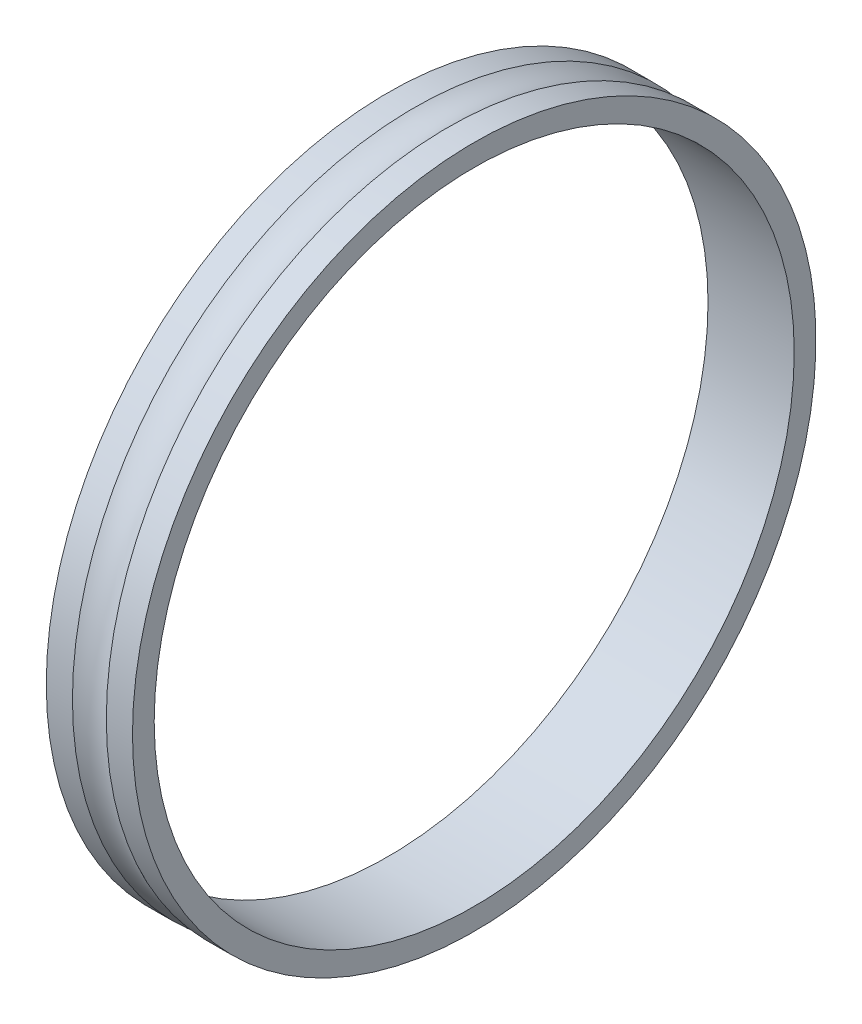
ISO-10303-21;
HEADER;
FILE_DESCRIPTION(('STEP AP214'),'2;1');
FILE_NAME('part.step','',(''),(''),'','','');
FILE_SCHEMA(('AUTOMOTIVE_DESIGN { 1 0 10303 214 1 1 1 1 }'));
ENDSEC;
DATA;
#1=APPLICATION_CONTEXT('core data for automotive mechanical design processes');
#2=APPLICATION_PROTOCOL_DEFINITION('international standard','automotive_design',2000,#1);
#3=PRODUCT_CONTEXT('',#1,'mechanical');
#4=PRODUCT('Part','Part','',(#3));
#5=PRODUCT_RELATED_PRODUCT_CATEGORY('part','',(#4));
#6=PRODUCT_DEFINITION_FORMATION('','',#4);
#7=PRODUCT_DEFINITION_CONTEXT('part definition',#1,'design');
#8=PRODUCT_DEFINITION('design','',#6,#7);
#9=PRODUCT_DEFINITION_SHAPE('','',#8);
#10=(LENGTH_UNIT() NAMED_UNIT(*) SI_UNIT(.MILLI.,.METRE.));
#11=(NAMED_UNIT(*) PLANE_ANGLE_UNIT() SI_UNIT($,.RADIAN.));
#12=(NAMED_UNIT(*) SI_UNIT($,.STERADIAN.) SOLID_ANGLE_UNIT());
#13=UNCERTAINTY_MEASURE_WITH_UNIT(LENGTH_MEASURE(1.E-05),#10,'distance_accuracy_value','');
#14=(GEOMETRIC_REPRESENTATION_CONTEXT(3) GLOBAL_UNCERTAINTY_ASSIGNED_CONTEXT((#13)) GLOBAL_UNIT_ASSIGNED_CONTEXT((#10,
#11,#12)) REPRESENTATION_CONTEXT('',''));
#15=CARTESIAN_POINT('',(0.,0.,0.));
#16=DIRECTION('',(0.,0.,1.));
#17=DIRECTION('',(1.,0.,0.));
#18=AXIS2_PLACEMENT_3D('',#15,#16,#17);
#19=CARTESIAN_POINT('',(64.16,0.,0.));
#20=DIRECTION('',(1.,0.,0.));
#21=DIRECTION('',(0.,0.,-1.));
#22=AXIS2_PLACEMENT_3D('',#19,#20,#21);
#23=TOROIDAL_SURFACE('',#22,69.3830000000004,7.15);
#24=CARTESIAN_POINT('',(67.2807388548227,0.,0.));
#25=DIRECTION('',(-1.,0.,0.));
#26=DIRECTION('',(0.,0.,1.00000000000001));
#27=AXIS2_PLACEMENT_3D('',#24,#25,#26);
#28=CIRCLE('',#27,62.95);
#29=CARTESIAN_POINT('',(67.2807388548227,0.,62.9500000000004));
#30=VERTEX_POINT('',#29);
#31=EDGE_CURVE('E38',#30,#30,#28,.F.);
#32=ORIENTED_EDGE('',*,*,#31,.F.);
#33=EDGE_LOOP('',(#32));
#34=FACE_BOUND('',#33,.T.);
#35=CARTESIAN_POINT('',(61.0392611451773,0.,0.));
#36=DIRECTION('',(-1.,0.,0.));
#37=DIRECTION('',(0.,0.,1.00000000000001));
#38=AXIS2_PLACEMENT_3D('',#35,#36,#37);
#39=CIRCLE('',#38,62.95);
#40=CARTESIAN_POINT('',(61.0392611451773,0.,62.9500000000004));
#41=VERTEX_POINT('',#40);
#42=EDGE_CURVE('E43',#41,#41,#39,.T.);
#43=ORIENTED_EDGE('',*,*,#42,.F.);
#44=EDGE_LOOP('',(#43));
#45=FACE_BOUND('',#44,.T.);
#46=ADVANCED_FACE('F22',(#34,#45),#23,.F.);
#47=CARTESIAN_POINT('',(64.16,0.,0.));
#48=DIRECTION('',(-1.,0.,0.));
#49=DIRECTION('',(0.,0.,1.00000000000001));
#50=AXIS2_PLACEMENT_3D('',#47,#48,#49);
#51=CYLINDRICAL_SURFACE('',#50,62.95);
#52=CARTESIAN_POINT('',(72.1,0.,0.));
#53=DIRECTION('',(-1.,0.,0.));
#54=DIRECTION('',(0.,0.,1.00000000000001));
#55=AXIS2_PLACEMENT_3D('',#52,#53,#54);
#56=CIRCLE('',#55,62.95);
#57=CARTESIAN_POINT('',(72.1,0.,62.9500000000004));
#58=VERTEX_POINT('',#57);
#59=EDGE_CURVE('E26',#58,#58,#56,.F.);
#60=ORIENTED_EDGE('',*,*,#59,.F.);
#61=EDGE_LOOP('',(#60));
#62=FACE_BOUND('',#61,.T.);
#63=ORIENTED_EDGE('',*,*,#31,.T.);
#64=EDGE_LOOP('',(#63));
#65=FACE_BOUND('',#64,.T.);
#66=ADVANCED_FACE('F54',(#62,#65),#51,.T.);
#67=CARTESIAN_POINT('',(64.16,0.,0.));
#68=DIRECTION('',(-1.,0.,0.));
#69=DIRECTION('',(0.,0.,1.00000000000001));
#70=AXIS2_PLACEMENT_3D('',#67,#68,#69);
#71=CYLINDRICAL_SURFACE('',#70,62.95);
#72=ORIENTED_EDGE('',*,*,#42,.T.);
#73=EDGE_LOOP('',(#72));
#74=FACE_BOUND('',#73,.T.);
#75=CARTESIAN_POINT('',(56.22,0.,0.));
#76=DIRECTION('',(-1.,0.,0.));
#77=DIRECTION('',(0.,0.,1.00000000000001));
#78=AXIS2_PLACEMENT_3D('',#75,#76,#77);
#79=CIRCLE('',#78,62.95);
#80=CARTESIAN_POINT('',(56.22,0.,62.9500000000004));
#81=VERTEX_POINT('',#80);
#82=EDGE_CURVE('E35',#81,#81,#79,.T.);
#83=ORIENTED_EDGE('',*,*,#82,.F.);
#84=EDGE_LOOP('',(#83));
#85=FACE_BOUND('',#84,.T.);
#86=ADVANCED_FACE('F62',(#74,#85),#71,.T.);
#87=CARTESIAN_POINT('',(72.1,0.,60.9500000000004));
#88=DIRECTION('',(1.,0.,0.));
#89=DIRECTION('',(0.,0.,-1.00000000000001));
#90=AXIS2_PLACEMENT_3D('',#87,#88,#89);
#91=PLANE('',#90);
#92=ORIENTED_EDGE('',*,*,#59,.T.);
#93=EDGE_LOOP('',(#92));
#94=FACE_BOUND('',#93,.T.);
#95=CARTESIAN_POINT('',(72.1,0.,0.));
#96=DIRECTION('',(-1.,0.,0.));
#97=DIRECTION('',(0.,0.,1.00000000000001));
#98=AXIS2_PLACEMENT_3D('',#95,#96,#97);
#99=CIRCLE('',#98,58.95);
#100=CARTESIAN_POINT('',(72.1,0.,58.9500000000004));
#101=VERTEX_POINT('',#100);
#102=EDGE_CURVE('E30',#101,#101,#99,.T.);
#103=ORIENTED_EDGE('',*,*,#102,.T.);
#104=EDGE_LOOP('',(#103));
#105=FACE_BOUND('',#104,.T.);
#106=ADVANCED_FACE('F72',(#94,#105),#91,.T.);
#107=CARTESIAN_POINT('',(56.22,0.,60.9500000000004));
#108=DIRECTION('',(-1.,0.,0.));
#109=DIRECTION('',(0.,0.,1.00000000000001));
#110=AXIS2_PLACEMENT_3D('',#107,#108,#109);
#111=PLANE('',#110);
#112=CARTESIAN_POINT('',(56.22,0.,0.));
#113=DIRECTION('',(-1.,0.,0.));
#114=DIRECTION('',(0.,0.,1.00000000000001));
#115=AXIS2_PLACEMENT_3D('',#112,#113,#114);
#116=CIRCLE('',#115,58.95);
#117=CARTESIAN_POINT('',(56.22,0.,58.9500000000004));
#118=VERTEX_POINT('',#117);
#119=EDGE_CURVE('E12',#118,#118,#116,.F.);
#120=ORIENTED_EDGE('',*,*,#119,.T.);
#121=EDGE_LOOP('',(#120));
#122=FACE_BOUND('',#121,.T.);
#123=ORIENTED_EDGE('',*,*,#82,.T.);
#124=EDGE_LOOP('',(#123));
#125=FACE_BOUND('',#124,.T.);
#126=ADVANCED_FACE('F66',(#122,#125),#111,.T.);
#127=CARTESIAN_POINT('',(64.16,0.,0.));
#128=DIRECTION('',(-1.,0.,0.));
#129=DIRECTION('',(0.,0.,1.00000000000001));
#130=AXIS2_PLACEMENT_3D('',#127,#128,#129);
#131=CYLINDRICAL_SURFACE('',#130,58.95);
#132=ORIENTED_EDGE('',*,*,#119,.F.);
#133=EDGE_LOOP('',(#132));
#134=FACE_BOUND('',#133,.T.);
#135=ORIENTED_EDGE('',*,*,#102,.F.);
#136=EDGE_LOOP('',(#135));
#137=FACE_BOUND('',#136,.T.);
#138=ADVANCED_FACE('F64',(#134,#137),#131,.F.);
#139=CLOSED_SHELL('',(#46,#66,#86,#106,#126,#138));
#140=MANIFOLD_SOLID_BREP('B1',#139);
#141=ADVANCED_BREP_SHAPE_REPRESENTATION('',(#18,#140),#14);
#142=SHAPE_DEFINITION_REPRESENTATION(#9,#141);
ENDSEC;
END-ISO-10303-21;
